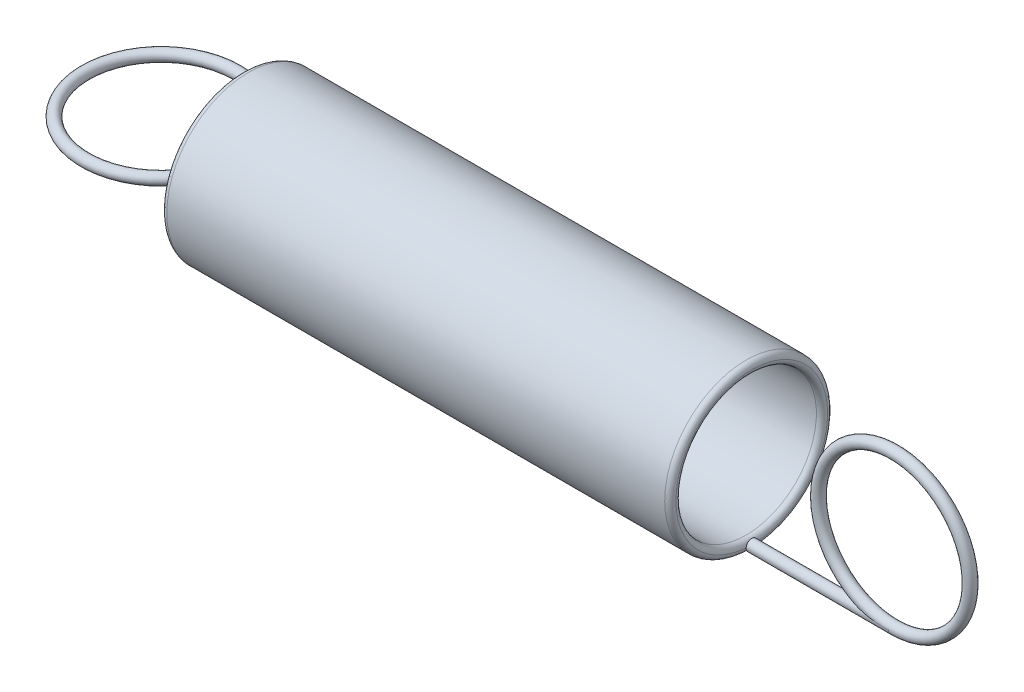
ISO-10303-21;
HEADER;
FILE_DESCRIPTION(('STEP AP214'),'2;1');
FILE_NAME('part.step','',(''),(''),'','','');
FILE_SCHEMA(('AUTOMOTIVE_DESIGN { 1 0 10303 214 1 1 1 1 }'));
ENDSEC;
DATA;
#1=APPLICATION_CONTEXT('core data for automotive mechanical design processes');
#2=APPLICATION_PROTOCOL_DEFINITION('international standard','automotive_design',2000,#1);
#3=PRODUCT_CONTEXT('',#1,'mechanical');
#4=PRODUCT('Part','Part','',(#3));
#5=PRODUCT_RELATED_PRODUCT_CATEGORY('part','',(#4));
#6=PRODUCT_DEFINITION_FORMATION('','',#4);
#7=PRODUCT_DEFINITION_CONTEXT('part definition',#1,'design');
#8=PRODUCT_DEFINITION('design','',#6,#7);
#9=PRODUCT_DEFINITION_SHAPE('','',#8);
#10=(LENGTH_UNIT() NAMED_UNIT(*) SI_UNIT(.MILLI.,.METRE.));
#11=(NAMED_UNIT(*) PLANE_ANGLE_UNIT() SI_UNIT($,.RADIAN.));
#12=(NAMED_UNIT(*) SI_UNIT($,.STERADIAN.) SOLID_ANGLE_UNIT());
#13=UNCERTAINTY_MEASURE_WITH_UNIT(LENGTH_MEASURE(1.E-05),#10,'distance_accuracy_value','');
#14=(GEOMETRIC_REPRESENTATION_CONTEXT(3) GLOBAL_UNCERTAINTY_ASSIGNED_CONTEXT((#13)) GLOBAL_UNIT_ASSIGNED_CONTEXT((#10,
#11,#12)) REPRESENTATION_CONTEXT('',''));
#15=CARTESIAN_POINT('',(0.,0.,0.));
#16=DIRECTION('',(0.,0.,1.));
#17=DIRECTION('',(1.,0.,0.));
#18=AXIS2_PLACEMENT_3D('',#15,#16,#17);
#19=CARTESIAN_POINT('',(40.,-3.725,0.));
#20=DIRECTION('',(-1.,0.,0.));
#21=DIRECTION('',(0.,0.,1.));
#22=AXIS2_PLACEMENT_3D('',#19,#20,#21);
#23=CYLINDRICAL_SURFACE('',#22,0.275);
#24=CARTESIAN_POINT('',(40.,-3.725,0.));
#25=DIRECTION('',(1.,0.,0.));
#26=DIRECTION('',(0.,0.,-1.));
#27=AXIS2_PLACEMENT_3D('',#24,#25,#26);
#28=CIRCLE('',#27,0.275);
#29=CARTESIAN_POINT('',(40.,-3.725,0.275));
#30=VERTEX_POINT('',#29);
#31=CARTESIAN_POINT('',(40.,-3.725,-0.275));
#32=VERTEX_POINT('',#31);
#33=EDGE_CURVE('E12',#30,#32,#28,.T.);
#34=ORIENTED_EDGE('',*,*,#33,.F.);
#35=CARTESIAN_POINT('',(40.,-3.725,0.275));
#36=CARTESIAN_POINT('',(39.9712280847813,-3.72500001379458,0.27499969519662));
#37=CARTESIAN_POINT('',(39.9424563495826,-3.72483331828989,0.275000124930359));
#38=CARTESIAN_POINT('',(39.9015992865078,-3.72435995947143,0.274999301992739));
#39=CARTESIAN_POINT('',(39.8895123091085,-3.72419050700876,0.274998880387503));
#40=CARTESIAN_POINT('',(39.8737055532412,-3.72393043978386,0.274997926907629));
#41=CARTESIAN_POINT('',(39.8699853322933,-3.72386644456711,0.274997673367113));
#42=CARTESIAN_POINT('',(39.8513844251557,-3.72353254056616,0.274996208223023));
#43=CARTESIAN_POINT('',(39.8365045195098,-3.72322085102561,0.274994404304387));
#44=CARTESIAN_POINT('',(39.7621055938286,-3.7214395034847,0.274980927521272));
#45=CARTESIAN_POINT('',(39.7026003949155,-3.71930133763204,0.274955883343978));
#46=CARTESIAN_POINT('',(39.6139757070446,-3.71505606385361,0.274823628046421));
#47=CARTESIAN_POINT('',(39.5848290126002,-3.71348870023724,0.274764808341644));
#48=CARTESIAN_POINT('',(39.5265853146749,-3.71001517883321,0.274596599238818));
#49=CARTESIAN_POINT('',(39.4974882905322,-3.70810935649531,0.274487259741127));
#50=CARTESIAN_POINT('',(39.3523065726715,-3.69774937678214,0.273778129453122));
#51=CARTESIAN_POINT('',(39.236383236791,-3.68676086026351,0.272689628655457));
#52=CARTESIAN_POINT('',(39.0625105380832,-3.6662427703074,0.268737190741708));
#53=CARTESIAN_POINT('',(39.0042933101508,-3.65868764899194,0.26702006638979));
#54=CARTESIAN_POINT('',(38.8881493952251,-3.64225873549015,0.26239755514299));
#55=CARTESIAN_POINT('',(38.830222467068,-3.63338633846066,0.259493419802166));
#56=CARTESIAN_POINT('',(38.7137370366709,-3.61419305826703,0.251902633659713));
#57=CARTESIAN_POINT('',(38.6551838986917,-3.60385067739334,0.247187342740117));
#58=CARTESIAN_POINT('',(38.5383261487982,-3.58184107294139,0.235141565496637));
#59=CARTESIAN_POINT('',(38.480023462416,-3.57016872487096,0.227800713341801));
#60=CARTESIAN_POINT('',(38.3938207365167,-3.5519123479893,0.213825774842245));
#61=CARTESIAN_POINT('',(38.3655774281775,-3.54576867997676,0.208740022517143));
#62=CARTESIAN_POINT('',(38.3093641290038,-3.53322415090012,0.197281754729124));
#63=CARTESIAN_POINT('',(38.2813945137155,-3.52682298516125,0.190907676755912));
#64=CARTESIAN_POINT('',(38.2261525105446,-3.51387406971852,0.176476464199501));
#65=CARTESIAN_POINT('',(38.1988765400455,-3.50732771746344,0.168431853861119));
#66=CARTESIAN_POINT('',(38.1452034042177,-3.49415713448411,0.149898383612481));
#67=CARTESIAN_POINT('',(38.118803992553,-3.48753317306806,0.139416429042418));
#68=CARTESIAN_POINT('',(38.0834092793282,-3.47847522597327,0.121983090624967));
#69=CARTESIAN_POINT('',(38.0735953739417,-3.47594347502394,0.116762543314822));
#70=CARTESIAN_POINT('',(38.0543717205208,-3.47094783953573,0.105457292497461));
#71=CARTESIAN_POINT('',(38.044964437952,-3.46848439471204,0.0993680797786158));
#72=CARTESIAN_POINT('',(38.0267529821241,-3.46368325614576,0.0859686157982807));
#73=CARTESIAN_POINT('',(38.0179619608333,-3.46134845307098,0.0786391690871558));
#74=CARTESIAN_POINT('',(38.0018606930414,-3.45704712827459,0.0624166766905616));
#75=CARTESIAN_POINT('',(37.9945371845844,-3.45507732155851,0.0535391311060757));
#76=CARTESIAN_POINT('',(37.9863703038286,-3.4528725650911,0.0398350915440287));
#77=CARTESIAN_POINT('',(37.9842881699422,-3.45230933413945,0.0358102974203782));
#78=CARTESIAN_POINT('',(37.9807254521478,-3.45134452259193,0.0274818173298881));
#79=CARTESIAN_POINT('',(37.9792443473689,-3.45094280202884,0.0231783766142001));
#80=CARTESIAN_POINT('',(37.9770126116688,-3.45033713824783,0.0143222425384726));
#81=CARTESIAN_POINT('',(37.9762691992201,-3.45013514951321,0.009767537753898));
#82=CARTESIAN_POINT('',(37.9756335964019,-3.44996246881461,0.000594444816961048));
#83=CARTESIAN_POINT('',(37.9757409929682,-3.44999166461151,-0.00402391134584772));
#84=CARTESIAN_POINT('',(37.9767376826842,-3.45026240057949,-0.0126973105791475));
#85=CARTESIAN_POINT('',(37.977547919,-3.45048247051591,-0.0167625938510804));
#86=CARTESIAN_POINT('',(37.9797636592698,-3.45108364776741,-0.0247136334554696));
#87=CARTESIAN_POINT('',(37.981169579986,-3.45146486782845,-0.0285992619800024));
#88=CARTESIAN_POINT('',(37.9853064471492,-3.45258496394375,-0.0380501427366304));
#89=CARTESIAN_POINT('',(37.9883478084202,-3.45340718432086,-0.0434685567236969));
#90=CARTESIAN_POINT('',(37.9951996504004,-3.45525419102246,-0.053755380688605));
#91=CARTESIAN_POINT('',(37.9990123329718,-3.45627955708205,-0.0586221524118155));
#92=CARTESIAN_POINT('',(38.0105784062301,-3.45937966651773,-0.0717480310713089));
#93=CARTESIAN_POINT('',(38.018949338692,-3.46161172635592,-0.07941800243768));
#94=CARTESIAN_POINT('',(38.0366050579852,-3.46628588742454,-0.0935244603923616));
#95=CARTESIAN_POINT('',(38.0458925165231,-3.46872859993882,-0.0999571693741835));
#96=CARTESIAN_POINT('',(38.0703960855305,-3.4751242139735,-0.115284382855649));
#97=CARTESIAN_POINT('',(38.0860004754149,-3.47915152278002,-0.12351988054952));
#98=CARTESIAN_POINT('',(38.1178981204361,-3.48727848191146,-0.138510756544871));
#99=CARTESIAN_POINT('',(38.1341929183767,-3.49137828087782,-0.145262586037801));
#100=CARTESIAN_POINT('',(38.1672781692397,-3.49959097715602,-0.157707344918711));
#101=CARTESIAN_POINT('',(38.1840707817425,-3.50370382962982,-0.163394506271934));
#102=CARTESIAN_POINT('',(38.2179062369853,-3.51187437927328,-0.17391500782928));
#103=CARTESIAN_POINT('',(38.234948760714,-3.51593213585548,-0.178749348659664));
#104=CARTESIAN_POINT('',(38.2863412905507,-3.52798961212237,-0.192246928346266));
#105=CARTESIAN_POINT('',(38.3209784920293,-3.53587907020486,-0.199912466288526));
#106=CARTESIAN_POINT('',(38.3906996984706,-3.55126655669992,-0.213411500214813));
#107=CARTESIAN_POINT('',(38.4257839825289,-3.55876432404018,-0.219243786957389));
#108=CARTESIAN_POINT('',(38.5316158303298,-3.58062589577793,-0.234745998749212));
#109=CARTESIAN_POINT('',(38.6027958778872,-3.59432346522089,-0.242388079663401));
#110=CARTESIAN_POINT('',(38.7457219489468,-3.61975849053716,-0.254444566660871));
#111=CARTESIAN_POINT('',(38.8174678598684,-3.63149632649365,-0.258859599180817));
#112=CARTESIAN_POINT('',(38.961274436017,-3.65293368096026,-0.265627366486787));
#113=CARTESIAN_POINT('',(39.0333346546136,-3.66263548501993,-0.267982423214955));
#114=CARTESIAN_POINT('',(39.1677097421452,-3.67876916663919,-0.271191738235928));
#115=CARTESIAN_POINT('',(39.2299895256437,-3.68546797053708,-0.272208892211207));
#116=CARTESIAN_POINT('',(39.3546388871282,-3.6973079782977,-0.273667400244857));
#117=CARTESIAN_POINT('',(39.4170083045266,-3.70245079368912,-0.27410935161507));
#118=CARTESIAN_POINT('',(39.5171804316363,-3.70945037289189,-0.274572429735833));
#119=CARTESIAN_POINT('',(39.5549489562594,-3.71180250380305,-0.274690846565613));
#120=CARTESIAN_POINT('',(39.6305244046315,-3.71593395163699,-0.274858363790184));
#121=CARTESIAN_POINT('',(39.6683313340454,-3.71771316591824,-0.274907451769615));
#122=CARTESIAN_POINT('',(39.7503001141593,-3.72094625307373,-0.274975681889648));
#123=CARTESIAN_POINT('',(39.794466144538,-3.72229577905489,-0.274988434194473));
#124=CARTESIAN_POINT('',(39.8636534810213,-3.72379431762452,-0.274997853257845));
#125=CARTESIAN_POINT('',(39.8886693153508,-3.72421015456231,-0.274999097952198));
#126=CARTESIAN_POINT('',(39.9424563688871,-3.724833320561,-0.275000060078828));
#127=CARTESIAN_POINT('',(39.9712280614434,-3.72500001905503,-0.274999520427269));
#128=CARTESIAN_POINT('',(40.,-3.725,-0.275));
#129=B_SPLINE_CURVE_WITH_KNOTS('',3,(#35,#36,#37,#38,#39,#40,#41,#42,#43,#44,#45,#46,#47,#48,
#49,#50,#51,#52,#53,#54,#55,#56,#57,#58,#59,#60,#61,#62,#63,#64,#65,#66,#67,#68,#69,#70,#71,#72,
#73,#74,#75,#76,#77,#78,#79,#80,#81,#82,#83,#84,#85,#86,#87,#88,#89,#90,#91,#92,#93,#94,#95,#96,
#97,#98,#99,#100,#101,#102,#103,#104,#105,#106,#107,#108,#109,#110,#111,#112,#113,#114,#115,
#116,#117,#118,#119,#120,#121,#122,#123,#124,#125,#126,#127,#128),.UNSPECIFIED.,.F.,.F.,(4,2,2,
2,2,2,2,2,2,2,2,2,2,2,2,2,2,2,2,2,2,2,2,2,2,2,2,2,2,2,2,2,2,2,2,2,2,2,2,2,2,2,2,2,2,2,4),(0.,
0.0863148307083246,0.122579190915519,0.133741499195704,0.178390920077402,0.357000618452352,
0.444565332405148,0.532043739582184,0.881207373912699,1.05738060344911,1.23336855764897,
1.41226232310665,1.59187030979809,1.67989335057898,1.76802379528046,1.85551593723331,
1.94276315842102,1.9769392508094,2.0112996825317,2.04625094450613,2.08087048911722,
2.09452875291038,2.10817515461062,2.12195380991452,2.13572577614903,2.14812409080427,
2.16053109412478,2.1792263097999,2.19797566681252,2.23249289791445,2.26711389981988,
2.32127010156141,2.37555446340418,2.43012490927728,2.48463089474508,2.59357052678436,
2.70258186705946,2.92106543592138,3.13950658134326,3.35770118807321,3.54562169965917,
3.73334691146513,3.84686867862547,3.96041077260431,4.09296304859212,4.16801980418973,
4.25433463489805),.UNSPECIFIED.);
#130=EDGE_CURVE('E60',#30,#32,#129,.T.);
#131=ORIENTED_EDGE('',*,*,#130,.T.);
#132=EDGE_LOOP('',(#34,#131));
#133=FACE_BOUND('',#132,.T.);
#134=CARTESIAN_POINT('',(33.,-3.725,0.));
#135=DIRECTION('',(1.,0.,0.));
#136=DIRECTION('',(0.,0.,-1.));
#137=AXIS2_PLACEMENT_3D('',#134,#135,#136);
#138=CIRCLE('',#137,0.275);
#139=CARTESIAN_POINT('',(33.,-3.725,-0.275));
#140=VERTEX_POINT('',#139);
#141=EDGE_CURVE('E50',#140,#140,#138,.T.);
#142=ORIENTED_EDGE('',*,*,#141,.T.);
#143=EDGE_LOOP('',(#142));
#144=FACE_BOUND('',#143,.T.);
#145=ADVANCED_FACE('F46',(#133,#144),#23,.T.);
#146=CARTESIAN_POINT('',(33.,-3.725,0.));
#147=DIRECTION('',(1.,0.,0.));
#148=DIRECTION('',(0.,0.,-1.));
#149=AXIS2_PLACEMENT_3D('',#146,#147,#148);
#150=PLANE('',#149);
#151=ORIENTED_EDGE('',*,*,#141,.F.);
#152=EDGE_LOOP('',(#151));
#153=FACE_BOUND('',#152,.T.);
#154=ADVANCED_FACE('F67',(#153),#150,.F.);
#155=CARTESIAN_POINT('',(40.,0.,0.));
#156=DIRECTION('',(0.,0.,1.));
#157=DIRECTION('',(1.,0.,0.));
#158=AXIS2_PLACEMENT_3D('',#155,#156,#157);
#159=TOROIDAL_SURFACE('',#158,3.725,0.275);
#160=ORIENTED_EDGE('',*,*,#33,.T.);
#161=ORIENTED_EDGE('',*,*,#130,.F.);
#162=EDGE_LOOP('',(#160,#161));
#163=FACE_BOUND('',#162,.T.);
#164=ADVANCED_FACE('F65',(#163),#159,.T.);
#165=CLOSED_SHELL('',(#145,#154,#164));
#166=MANIFOLD_SOLID_BREP('B2',#165);
#167=CARTESIAN_POINT('',(8.,0.,0.));
#168=DIRECTION('',(-1.,0.,0.));
#169=DIRECTION('',(0.,0.,1.));
#170=AXIS2_PLACEMENT_3D('',#167,#168,#169);
#171=CYLINDRICAL_SURFACE('',#170,3.45);
#172=CARTESIAN_POINT('',(32.725,0.,0.));
#173=DIRECTION('',(-1.,0.,0.));
#174=DIRECTION('',(0.,0.,1.));
#175=AXIS2_PLACEMENT_3D('',#172,#173,#174);
#176=CIRCLE('',#175,3.45);
#177=CARTESIAN_POINT('',(32.725,0.,3.45));
#178=VERTEX_POINT('',#177);
#179=EDGE_CURVE('E121',#178,#178,#176,.F.);
#180=ORIENTED_EDGE('',*,*,#179,.T.);
#181=EDGE_LOOP('',(#180));
#182=FACE_BOUND('',#181,.T.);
#183=CARTESIAN_POINT('',(8.275,0.,0.));
#184=DIRECTION('',(1.,0.,0.));
#185=DIRECTION('',(0.,0.,-1.));
#186=AXIS2_PLACEMENT_3D('',#183,#184,#185);
#187=CIRCLE('',#186,3.45);
#188=CARTESIAN_POINT('',(8.275,0.,-3.45));
#189=VERTEX_POINT('',#188);
#190=EDGE_CURVE('E126',#189,#189,#187,.F.);
#191=ORIENTED_EDGE('',*,*,#190,.T.);
#192=EDGE_LOOP('',(#191));
#193=FACE_BOUND('',#192,.T.);
#194=ADVANCED_FACE('F106',(#182,#193),#171,.F.);
#195=CARTESIAN_POINT('',(8.,0.,0.));
#196=DIRECTION('',(-1.,0.,0.));
#197=DIRECTION('',(0.,0.,1.));
#198=AXIS2_PLACEMENT_3D('',#195,#196,#197);
#199=CYLINDRICAL_SURFACE('',#198,4.);
#200=CARTESIAN_POINT('',(32.725,0.,0.));
#201=DIRECTION('',(-1.,0.,0.));
#202=DIRECTION('',(0.,0.,1.));
#203=AXIS2_PLACEMENT_3D('',#200,#201,#202);
#204=CIRCLE('',#203,4.);
#205=CARTESIAN_POINT('',(32.725,0.,4.));
#206=VERTEX_POINT('',#205);
#207=EDGE_CURVE('E45',#206,#206,#204,.T.);
#208=ORIENTED_EDGE('',*,*,#207,.T.);
#209=EDGE_LOOP('',(#208));
#210=FACE_BOUND('',#209,.T.);
#211=CARTESIAN_POINT('',(8.275,0.,0.));
#212=DIRECTION('',(1.,0.,0.));
#213=DIRECTION('',(0.,0.,-1.));
#214=AXIS2_PLACEMENT_3D('',#211,#212,#213);
#215=CIRCLE('',#214,4.);
#216=CARTESIAN_POINT('',(8.275,0.,-4.));
#217=VERTEX_POINT('',#216);
#218=EDGE_CURVE('E115',#217,#217,#215,.T.);
#219=ORIENTED_EDGE('',*,*,#218,.T.);
#220=EDGE_LOOP('',(#219));
#221=FACE_BOUND('',#220,.T.);
#222=ADVANCED_FACE('F150',(#210,#221),#199,.T.);
#223=CARTESIAN_POINT('',(32.725,0.,0.));
#224=DIRECTION('',(-1.,0.,0.));
#225=DIRECTION('',(0.,0.,1.));
#226=AXIS2_PLACEMENT_3D('',#223,#224,#225);
#227=TOROIDAL_SURFACE('',#226,3.725,0.275);
#228=ORIENTED_EDGE('',*,*,#207,.F.);
#229=EDGE_LOOP('',(#228));
#230=FACE_BOUND('',#229,.T.);
#231=CARTESIAN_POINT('',(33.,0.,0.));
#232=DIRECTION('',(-1.,0.,0.));
#233=DIRECTION('',(0.,0.,1.));
#234=AXIS2_PLACEMENT_3D('',#231,#232,#233);
#235=CIRCLE('',#234,3.725);
#236=CARTESIAN_POINT('',(33.,0.,3.725));
#237=VERTEX_POINT('',#236);
#238=EDGE_CURVE('E124',#237,#237,#235,.F.);
#239=ORIENTED_EDGE('',*,*,#238,.F.);
#240=EDGE_LOOP('',(#239));
#241=FACE_BOUND('',#240,.T.);
#242=ADVANCED_FACE('F145',(#230,#241),#227,.T.);
#243=CARTESIAN_POINT('',(32.725,0.,0.));
#244=DIRECTION('',(-1.,0.,0.));
#245=DIRECTION('',(0.,0.,1.));
#246=AXIS2_PLACEMENT_3D('',#243,#244,#245);
#247=TOROIDAL_SURFACE('',#246,3.725,0.275);
#248=ORIENTED_EDGE('',*,*,#179,.F.);
#249=EDGE_LOOP('',(#248));
#250=FACE_BOUND('',#249,.T.);
#251=ORIENTED_EDGE('',*,*,#238,.T.);
#252=EDGE_LOOP('',(#251));
#253=FACE_BOUND('',#252,.T.);
#254=ADVANCED_FACE('F139',(#250,#253),#247,.T.);
#255=CARTESIAN_POINT('',(8.275,0.,0.));
#256=DIRECTION('',(1.,0.,0.));
#257=DIRECTION('',(0.,0.,-1.));
#258=AXIS2_PLACEMENT_3D('',#255,#256,#257);
#259=TOROIDAL_SURFACE('',#258,3.725,0.275);
#260=ORIENTED_EDGE('',*,*,#218,.F.);
#261=EDGE_LOOP('',(#260));
#262=FACE_BOUND('',#261,.T.);
#263=CARTESIAN_POINT('',(8.,0.,0.));
#264=DIRECTION('',(1.,0.,0.));
#265=DIRECTION('',(0.,0.,-1.));
#266=AXIS2_PLACEMENT_3D('',#263,#264,#265);
#267=CIRCLE('',#266,3.725);
#268=CARTESIAN_POINT('',(8.,0.,-3.725));
#269=VERTEX_POINT('',#268);
#270=EDGE_CURVE('E110',#269,#269,#267,.F.);
#271=ORIENTED_EDGE('',*,*,#270,.F.);
#272=EDGE_LOOP('',(#271));
#273=FACE_BOUND('',#272,.T.);
#274=ADVANCED_FACE('F108',(#262,#273),#259,.T.);
#275=CARTESIAN_POINT('',(8.275,0.,0.));
#276=DIRECTION('',(1.,0.,0.));
#277=DIRECTION('',(0.,0.,-1.));
#278=AXIS2_PLACEMENT_3D('',#275,#276,#277);
#279=TOROIDAL_SURFACE('',#278,3.725,0.275);
#280=ORIENTED_EDGE('',*,*,#270,.T.);
#281=EDGE_LOOP('',(#280));
#282=FACE_BOUND('',#281,.T.);
#283=ORIENTED_EDGE('',*,*,#190,.F.);
#284=EDGE_LOOP('',(#283));
#285=FACE_BOUND('',#284,.T.);
#286=ADVANCED_FACE('F135',(#282,#285),#279,.T.);
#287=CLOSED_SHELL('',(#194,#222,#242,#254,#274,#286));
#288=MANIFOLD_SOLID_BREP('B6',#287);
#289=CARTESIAN_POINT('',(4.,0.,0.));
#290=DIRECTION('',(0.,-1.,0.));
#291=DIRECTION('',(0.,0.,-1.));
#292=AXIS2_PLACEMENT_3D('',#289,#290,#291);
#293=TOROIDAL_SURFACE('',#292,3.725,0.275);
#294=CARTESIAN_POINT('',(4.,0.,-4.));
#295=VERTEX_POINT('',#294);
#296=VERTEX_LOOP('',#295);
#297=FACE_BOUND('',#296,.T.);
#298=ADVANCED_FACE('F204',(#297),#293,.T.);
#299=CLOSED_SHELL('',(#298));
#300=MANIFOLD_SOLID_BREP('B40',#299);
#301=ADVANCED_BREP_SHAPE_REPRESENTATION('',(#18,#166,#288,#300),#14);
#302=SHAPE_DEFINITION_REPRESENTATION(#9,#301);
ENDSEC;
END-ISO-10303-21;
